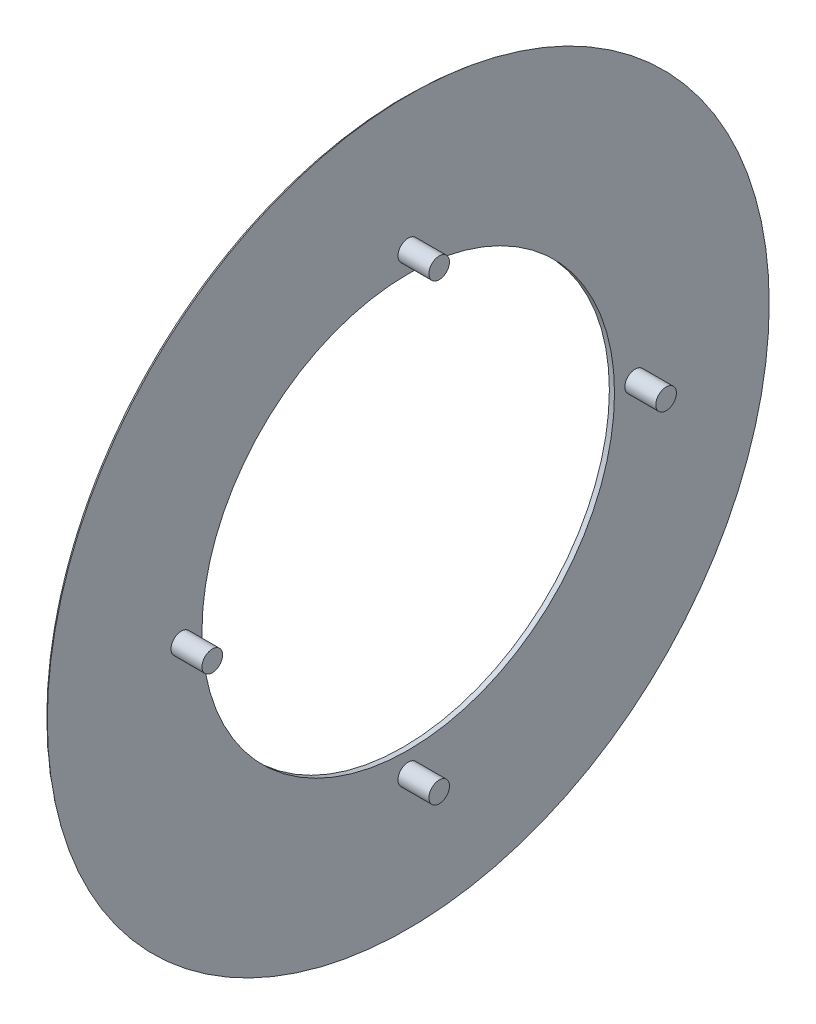
ISO-10303-21;
HEADER;
FILE_DESCRIPTION(('STEP AP214'),'2;1');
FILE_NAME('part.step','',(''),(''),'','','');
FILE_SCHEMA(('AUTOMOTIVE_DESIGN { 1 0 10303 214 1 1 1 1 }'));
ENDSEC;
DATA;
#1=APPLICATION_CONTEXT('core data for automotive mechanical design processes');
#2=APPLICATION_PROTOCOL_DEFINITION('international standard','automotive_design',2000,#1);
#3=PRODUCT_CONTEXT('',#1,'mechanical');
#4=PRODUCT('Part','Part','',(#3));
#5=PRODUCT_RELATED_PRODUCT_CATEGORY('part','',(#4));
#6=PRODUCT_DEFINITION_FORMATION('','',#4);
#7=PRODUCT_DEFINITION_CONTEXT('part definition',#1,'design');
#8=PRODUCT_DEFINITION('design','',#6,#7);
#9=PRODUCT_DEFINITION_SHAPE('','',#8);
#10=(LENGTH_UNIT() NAMED_UNIT(*) SI_UNIT(.MILLI.,.METRE.));
#11=(NAMED_UNIT(*) PLANE_ANGLE_UNIT() SI_UNIT($,.RADIAN.));
#12=(NAMED_UNIT(*) SI_UNIT($,.STERADIAN.) SOLID_ANGLE_UNIT());
#13=UNCERTAINTY_MEASURE_WITH_UNIT(LENGTH_MEASURE(1.E-05),#10,'distance_accuracy_value','');
#14=(GEOMETRIC_REPRESENTATION_CONTEXT(3) GLOBAL_UNCERTAINTY_ASSIGNED_CONTEXT((#13)) GLOBAL_UNIT_ASSIGNED_CONTEXT((#10,
#11,#12)) REPRESENTATION_CONTEXT('',''));
#15=CARTESIAN_POINT('',(0.,0.,0.));
#16=DIRECTION('',(0.,0.,1.));
#17=DIRECTION('',(1.,0.,0.));
#18=AXIS2_PLACEMENT_3D('',#15,#16,#17);
#19=CARTESIAN_POINT('',(0.635,0.,0.));
#20=DIRECTION('',(1.,0.,0.));
#21=DIRECTION('',(0.,0.,-1.));
#22=AXIS2_PLACEMENT_3D('',#19,#20,#21);
#23=PLANE('',#22);
#24=CARTESIAN_POINT('',(0.635,0.,0.));
#25=DIRECTION('',(1.,0.,0.));
#26=DIRECTION('',(0.,0.,-1.));
#27=AXIS2_PLACEMENT_3D('',#24,#25,#26);
#28=CIRCLE('',#27,25.4);
#29=CARTESIAN_POINT('',(0.635,0.,-25.4));
#30=VERTEX_POINT('',#29);
#31=EDGE_CURVE('E73',#30,#30,#28,.T.);
#32=ORIENTED_EDGE('',*,*,#31,.F.);
#33=EDGE_LOOP('',(#32));
#34=FACE_BOUND('',#33,.T.);
#35=CARTESIAN_POINT('',(0.635,-27.94,0.));
#36=DIRECTION('',(1.,0.,0.));
#37=DIRECTION('',(0.,0.,-1.));
#38=AXIS2_PLACEMENT_3D('',#35,#36,#37);
#39=CIRCLE('',#38,1.27);
#40=CARTESIAN_POINT('',(0.635,-27.94,1.26999999999999));
#41=VERTEX_POINT('',#40);
#42=EDGE_CURVE('E59',#41,#41,#39,.T.);
#43=ORIENTED_EDGE('',*,*,#42,.F.);
#44=EDGE_LOOP('',(#43));
#45=FACE_BOUND('',#44,.T.);
#46=CARTESIAN_POINT('',(0.635,27.94,0.));
#47=DIRECTION('',(1.,0.,0.));
#48=DIRECTION('',(0.,0.,-1.));
#49=AXIS2_PLACEMENT_3D('',#46,#47,#48);
#50=CIRCLE('',#49,1.27);
#51=CARTESIAN_POINT('',(0.635,27.94,1.27));
#52=VERTEX_POINT('',#51);
#53=EDGE_CURVE('E47',#52,#52,#50,.T.);
#54=ORIENTED_EDGE('',*,*,#53,.F.);
#55=EDGE_LOOP('',(#54));
#56=FACE_BOUND('',#55,.T.);
#57=CARTESIAN_POINT('',(0.635,0.,0.));
#58=DIRECTION('',(1.,0.,0.));
#59=DIRECTION('',(0.,0.,-1.));
#60=AXIS2_PLACEMENT_3D('',#57,#58,#59);
#61=CIRCLE('',#60,44.45);
#62=CARTESIAN_POINT('',(0.635,0.,-44.45));
#63=VERTEX_POINT('',#62);
#64=EDGE_CURVE('E39',#63,#63,#61,.T.);
#65=ORIENTED_EDGE('',*,*,#64,.T.);
#66=EDGE_LOOP('',(#65));
#67=FACE_BOUND('',#66,.T.);
#68=CARTESIAN_POINT('',(0.635,0.,-27.94));
#69=DIRECTION('',(1.,0.,0.));
#70=DIRECTION('',(0.,0.,-1.));
#71=AXIS2_PLACEMENT_3D('',#68,#69,#70);
#72=CIRCLE('',#71,1.27);
#73=CARTESIAN_POINT('',(0.635,0.,-26.67));
#74=VERTEX_POINT('',#73);
#75=EDGE_CURVE('E53',#74,#74,#72,.T.);
#76=ORIENTED_EDGE('',*,*,#75,.F.);
#77=EDGE_LOOP('',(#76));
#78=FACE_BOUND('',#77,.T.);
#79=CARTESIAN_POINT('',(0.635,0.,27.94));
#80=DIRECTION('',(1.,0.,0.));
#81=DIRECTION('',(0.,0.,-1.));
#82=AXIS2_PLACEMENT_3D('',#79,#80,#81);
#83=CIRCLE('',#82,1.27);
#84=CARTESIAN_POINT('',(0.635,0.,29.21));
#85=VERTEX_POINT('',#84);
#86=EDGE_CURVE('E65',#85,#85,#83,.T.);
#87=ORIENTED_EDGE('',*,*,#86,.F.);
#88=EDGE_LOOP('',(#87));
#89=FACE_BOUND('',#88,.T.);
#90=ADVANCED_FACE('F32',(#34,#45,#56,#67,#78,#89),#23,.T.);
#91=CARTESIAN_POINT('',(0.,0.,0.));
#92=DIRECTION('',(1.,0.,0.));
#93=DIRECTION('',(0.,0.,-1.));
#94=AXIS2_PLACEMENT_3D('',#91,#92,#93);
#95=PLANE('',#94);
#96=CARTESIAN_POINT('',(0.,0.,0.));
#97=DIRECTION('',(1.,0.,0.));
#98=DIRECTION('',(0.,0.,-1.));
#99=AXIS2_PLACEMENT_3D('',#96,#97,#98);
#100=CIRCLE('',#99,43.3501477371938);
#101=CARTESIAN_POINT('',(0.,0.,-43.3501477371938));
#102=VERTEX_POINT('',#101);
#103=EDGE_CURVE('E10',#102,#102,#100,.F.);
#104=ORIENTED_EDGE('',*,*,#103,.T.);
#105=EDGE_LOOP('',(#104));
#106=FACE_BOUND('',#105,.T.);
#107=CARTESIAN_POINT('',(0.,0.,0.));
#108=DIRECTION('',(1.,0.,0.));
#109=DIRECTION('',(0.,0.,-1.));
#110=AXIS2_PLACEMENT_3D('',#107,#108,#109);
#111=CIRCLE('',#110,25.4);
#112=CARTESIAN_POINT('',(0.,0.,-25.4));
#113=VERTEX_POINT('',#112);
#114=EDGE_CURVE('E68',#113,#113,#111,.F.);
#115=ORIENTED_EDGE('',*,*,#114,.F.);
#116=EDGE_LOOP('',(#115));
#117=FACE_BOUND('',#116,.T.);
#118=ADVANCED_FACE('F82',(#106,#117),#95,.F.);
#119=CARTESIAN_POINT('',(4.445,27.94,0.));
#120=DIRECTION('',(-1.,0.,0.));
#121=DIRECTION('',(0.,0.,1.));
#122=AXIS2_PLACEMENT_3D('',#119,#120,#121);
#123=CYLINDRICAL_SURFACE('',#122,1.27);
#124=CARTESIAN_POINT('',(4.445,27.94,0.));
#125=DIRECTION('',(1.,0.,0.));
#126=DIRECTION('',(0.,0.,-1.));
#127=AXIS2_PLACEMENT_3D('',#124,#125,#126);
#128=CIRCLE('',#127,1.27);
#129=CARTESIAN_POINT('',(4.445,27.94,1.27));
#130=VERTEX_POINT('',#129);
#131=EDGE_CURVE('E43',#130,#130,#128,.T.);
#132=CARTESIAN_POINT('',(4.445,27.94,1.27));
#133=CARTESIAN_POINT('',(4.4053125,27.94,1.27));
#134=CARTESIAN_POINT('',(4.365625,27.94,1.27));
#135=CARTESIAN_POINT('',(4.28625,27.94,1.27));
#136=CARTESIAN_POINT('',(4.2465625,27.94,1.27));
#137=CARTESIAN_POINT('',(4.1671875,27.94,1.27));
#138=CARTESIAN_POINT('',(4.1275,27.94,1.27));
#139=CARTESIAN_POINT('',(4.048125,27.94,1.27));
#140=CARTESIAN_POINT('',(4.0084375,27.94,1.27));
#141=CARTESIAN_POINT('',(3.9290625,27.94,1.27));
#142=CARTESIAN_POINT('',(3.889375,27.94,1.27));
#143=CARTESIAN_POINT('',(3.81,27.94,1.27));
#144=CARTESIAN_POINT('',(3.7703125,27.94,1.27));
#145=CARTESIAN_POINT('',(3.6909375,27.94,1.27));
#146=CARTESIAN_POINT('',(3.65125,27.94,1.27));
#147=CARTESIAN_POINT('',(3.571875,27.94,1.27));
#148=CARTESIAN_POINT('',(3.5321875,27.94,1.27));
#149=CARTESIAN_POINT('',(3.4528125,27.94,1.27));
#150=CARTESIAN_POINT('',(3.413125,27.94,1.27));
#151=CARTESIAN_POINT('',(3.33375,27.94,1.27));
#152=CARTESIAN_POINT('',(3.2940625,27.94,1.27));
#153=CARTESIAN_POINT('',(3.2146875,27.94,1.27));
#154=CARTESIAN_POINT('',(3.175,27.94,1.27));
#155=CARTESIAN_POINT('',(3.095625,27.94,1.27));
#156=CARTESIAN_POINT('',(3.0559375,27.94,1.27));
#157=CARTESIAN_POINT('',(2.9765625,27.94,1.27));
#158=CARTESIAN_POINT('',(2.936875,27.94,1.27));
#159=CARTESIAN_POINT('',(2.8575,27.94,1.27));
#160=CARTESIAN_POINT('',(2.8178125,27.94,1.27));
#161=CARTESIAN_POINT('',(2.7384375,27.94,1.27));
#162=CARTESIAN_POINT('',(2.69875,27.94,1.27));
#163=CARTESIAN_POINT('',(2.619375,27.94,1.27));
#164=CARTESIAN_POINT('',(2.5796875,27.94,1.27));
#165=CARTESIAN_POINT('',(2.5003125,27.94,1.27));
#166=CARTESIAN_POINT('',(2.460625,27.94,1.27));
#167=CARTESIAN_POINT('',(2.38125,27.94,1.27));
#168=CARTESIAN_POINT('',(2.3415625,27.94,1.27));
#169=CARTESIAN_POINT('',(2.2621875,27.94,1.27));
#170=CARTESIAN_POINT('',(2.2225,27.94,1.27));
#171=CARTESIAN_POINT('',(2.143125,27.94,1.27));
#172=CARTESIAN_POINT('',(2.1034375,27.94,1.27));
#173=CARTESIAN_POINT('',(2.0240625,27.94,1.27));
#174=CARTESIAN_POINT('',(1.984375,27.94,1.27));
#175=CARTESIAN_POINT('',(1.905,27.94,1.27));
#176=CARTESIAN_POINT('',(1.8653125,27.94,1.27));
#177=CARTESIAN_POINT('',(1.7859375,27.94,1.27));
#178=CARTESIAN_POINT('',(1.74625,27.94,1.27));
#179=CARTESIAN_POINT('',(1.666875,27.94,1.27));
#180=CARTESIAN_POINT('',(1.6271875,27.94,1.27));
#181=CARTESIAN_POINT('',(1.5478125,27.94,1.27));
#182=CARTESIAN_POINT('',(1.508125,27.94,1.27));
#183=CARTESIAN_POINT('',(1.42875,27.94,1.27));
#184=CARTESIAN_POINT('',(1.3890625,27.94,1.27));
#185=CARTESIAN_POINT('',(1.3096875,27.94,1.27));
#186=CARTESIAN_POINT('',(1.27,27.94,1.27));
#187=CARTESIAN_POINT('',(1.190625,27.94,1.27));
#188=CARTESIAN_POINT('',(1.1509375,27.94,1.27));
#189=CARTESIAN_POINT('',(1.0715625,27.94,1.27));
#190=CARTESIAN_POINT('',(1.031875,27.94,1.27));
#191=CARTESIAN_POINT('',(0.9525,27.94,1.27));
#192=CARTESIAN_POINT('',(0.9128125,27.94,1.27));
#193=CARTESIAN_POINT('',(0.8334375,27.94,1.27));
#194=CARTESIAN_POINT('',(0.79375,27.94,1.27));
#195=CARTESIAN_POINT('',(0.714375,27.94,1.27));
#196=CARTESIAN_POINT('',(0.6746875,27.94,1.27));
#197=CARTESIAN_POINT('',(0.635,27.94,1.27));
#198=B_SPLINE_CURVE_WITH_KNOTS('',3,(#132,#133,#134,#135,#136,#137,#138,#139,#140,#141,#142,
#143,#144,#145,#146,#147,#148,#149,#150,#151,#152,#153,#154,#155,#156,#157,#158,#159,#160,#161,
#162,#163,#164,#165,#166,#167,#168,#169,#170,#171,#172,#173,#174,#175,#176,#177,#178,#179,#180,
#181,#182,#183,#184,#185,#186,#187,#188,#189,#190,#191,#192,#193,#194,#195,#196,#197),
.UNSPECIFIED.,.F.,.F.,(4,2,2,2,2,2,2,2,2,2,2,2,2,2,2,2,2,2,2,2,2,2,2,2,2,2,2,2,2,2,2,2,4),(0.,
0.119062499999999,0.238125,0.3571875,0.476249999999999,0.595312499999999,0.714374999999999,
0.833437499999999,0.952499999999999,1.0715625,1.190625,1.3096875,1.42875,1.5478125,1.666875,
1.7859375,1.905,2.0240625,2.143125,2.2621875,2.38125,2.5003125,2.619375,2.7384375,2.8575,
2.9765625,3.095625,3.2146875,3.33375,3.4528125,3.571875,3.6909375,3.81),.UNSPECIFIED.);
#199=EDGE_CURVE('BSEAM124',#130,#52,#198,.T.);
#200=ORIENTED_EDGE('',*,*,#131,.F.);
#201=ORIENTED_EDGE('',*,*,#53,.T.);
#202=ORIENTED_EDGE('',*,*,#199,.T.);
#203=ORIENTED_EDGE('',*,*,#199,.F.);
#204=EDGE_LOOP('',(#200,#202,#201,#203));
#205=FACE_BOUND('',#204,.T.);
#206=ADVANCED_FACE('F124',(#205),#123,.T.);
#207=CARTESIAN_POINT('',(4.445,27.94,0.));
#208=DIRECTION('',(1.,0.,0.));
#209=DIRECTION('',(0.,0.,-1.));
#210=AXIS2_PLACEMENT_3D('',#207,#208,#209);
#211=PLANE('',#210);
#212=ORIENTED_EDGE('',*,*,#131,.T.);
#213=EDGE_LOOP('',(#212));
#214=FACE_BOUND('',#213,.T.);
#215=ADVANCED_FACE('F120',(#214),#211,.T.);
#216=CARTESIAN_POINT('',(4.445,0.,-27.94));
#217=DIRECTION('',(-1.,0.,0.));
#218=DIRECTION('',(0.,0.,1.));
#219=AXIS2_PLACEMENT_3D('',#216,#217,#218);
#220=CYLINDRICAL_SURFACE('',#219,1.27);
#221=CARTESIAN_POINT('',(4.445,0.,-27.94));
#222=DIRECTION('',(1.,0.,0.));
#223=DIRECTION('',(0.,0.,-1.));
#224=AXIS2_PLACEMENT_3D('',#221,#222,#223);
#225=CIRCLE('',#224,1.27);
#226=CARTESIAN_POINT('',(4.445,0.,-26.67));
#227=VERTEX_POINT('',#226);
#228=EDGE_CURVE('E51',#227,#227,#225,.T.);
#229=CARTESIAN_POINT('',(4.445,0.,-26.67));
#230=CARTESIAN_POINT('',(4.4053125,0.,-26.67));
#231=CARTESIAN_POINT('',(4.365625,0.,-26.67));
#232=CARTESIAN_POINT('',(4.28625,0.,-26.67));
#233=CARTESIAN_POINT('',(4.2465625,0.,-26.67));
#234=CARTESIAN_POINT('',(4.1671875,0.,-26.67));
#235=CARTESIAN_POINT('',(4.1275,0.,-26.67));
#236=CARTESIAN_POINT('',(4.048125,0.,-26.67));
#237=CARTESIAN_POINT('',(4.0084375,0.,-26.67));
#238=CARTESIAN_POINT('',(3.9290625,0.,-26.67));
#239=CARTESIAN_POINT('',(3.889375,0.,-26.67));
#240=CARTESIAN_POINT('',(3.81,0.,-26.67));
#241=CARTESIAN_POINT('',(3.7703125,0.,-26.67));
#242=CARTESIAN_POINT('',(3.6909375,0.,-26.67));
#243=CARTESIAN_POINT('',(3.65125,0.,-26.67));
#244=CARTESIAN_POINT('',(3.571875,0.,-26.67));
#245=CARTESIAN_POINT('',(3.5321875,0.,-26.67));
#246=CARTESIAN_POINT('',(3.4528125,0.,-26.67));
#247=CARTESIAN_POINT('',(3.413125,0.,-26.67));
#248=CARTESIAN_POINT('',(3.33375,0.,-26.67));
#249=CARTESIAN_POINT('',(3.2940625,0.,-26.67));
#250=CARTESIAN_POINT('',(3.2146875,0.,-26.67));
#251=CARTESIAN_POINT('',(3.175,0.,-26.67));
#252=CARTESIAN_POINT('',(3.095625,0.,-26.67));
#253=CARTESIAN_POINT('',(3.0559375,0.,-26.67));
#254=CARTESIAN_POINT('',(2.9765625,0.,-26.67));
#255=CARTESIAN_POINT('',(2.936875,0.,-26.67));
#256=CARTESIAN_POINT('',(2.8575,0.,-26.67));
#257=CARTESIAN_POINT('',(2.8178125,0.,-26.67));
#258=CARTESIAN_POINT('',(2.7384375,0.,-26.67));
#259=CARTESIAN_POINT('',(2.69875,0.,-26.67));
#260=CARTESIAN_POINT('',(2.619375,0.,-26.67));
#261=CARTESIAN_POINT('',(2.5796875,0.,-26.67));
#262=CARTESIAN_POINT('',(2.5003125,0.,-26.67));
#263=CARTESIAN_POINT('',(2.460625,0.,-26.67));
#264=CARTESIAN_POINT('',(2.38125,0.,-26.67));
#265=CARTESIAN_POINT('',(2.3415625,0.,-26.67));
#266=CARTESIAN_POINT('',(2.2621875,0.,-26.67));
#267=CARTESIAN_POINT('',(2.2225,0.,-26.67));
#268=CARTESIAN_POINT('',(2.143125,0.,-26.67));
#269=CARTESIAN_POINT('',(2.1034375,0.,-26.67));
#270=CARTESIAN_POINT('',(2.0240625,0.,-26.67));
#271=CARTESIAN_POINT('',(1.984375,0.,-26.67));
#272=CARTESIAN_POINT('',(1.905,0.,-26.67));
#273=CARTESIAN_POINT('',(1.8653125,0.,-26.67));
#274=CARTESIAN_POINT('',(1.7859375,0.,-26.67));
#275=CARTESIAN_POINT('',(1.74625,0.,-26.67));
#276=CARTESIAN_POINT('',(1.666875,0.,-26.67));
#277=CARTESIAN_POINT('',(1.6271875,0.,-26.67));
#278=CARTESIAN_POINT('',(1.5478125,0.,-26.67));
#279=CARTESIAN_POINT('',(1.508125,0.,-26.67));
#280=CARTESIAN_POINT('',(1.42875,0.,-26.67));
#281=CARTESIAN_POINT('',(1.3890625,0.,-26.67));
#282=CARTESIAN_POINT('',(1.3096875,0.,-26.67));
#283=CARTESIAN_POINT('',(1.27,0.,-26.67));
#284=CARTESIAN_POINT('',(1.190625,0.,-26.67));
#285=CARTESIAN_POINT('',(1.1509375,0.,-26.67));
#286=CARTESIAN_POINT('',(1.0715625,0.,-26.67));
#287=CARTESIAN_POINT('',(1.031875,0.,-26.67));
#288=CARTESIAN_POINT('',(0.9525,0.,-26.67));
#289=CARTESIAN_POINT('',(0.9128125,0.,-26.67));
#290=CARTESIAN_POINT('',(0.8334375,0.,-26.67));
#291=CARTESIAN_POINT('',(0.79375,0.,-26.67));
#292=CARTESIAN_POINT('',(0.714375,0.,-26.67));
#293=CARTESIAN_POINT('',(0.6746875,0.,-26.67));
#294=CARTESIAN_POINT('',(0.635,0.,-26.67));
#295=B_SPLINE_CURVE_WITH_KNOTS('',3,(#229,#230,#231,#232,#233,#234,#235,#236,#237,#238,#239,
#240,#241,#242,#243,#244,#245,#246,#247,#248,#249,#250,#251,#252,#253,#254,#255,#256,#257,#258,
#259,#260,#261,#262,#263,#264,#265,#266,#267,#268,#269,#270,#271,#272,#273,#274,#275,#276,#277,
#278,#279,#280,#281,#282,#283,#284,#285,#286,#287,#288,#289,#290,#291,#292,#293,#294),
.UNSPECIFIED.,.F.,.F.,(4,2,2,2,2,2,2,2,2,2,2,2,2,2,2,2,2,2,2,2,2,2,2,2,2,2,2,2,2,2,2,2,4),(0.,
0.119062499999999,0.238125,0.3571875,0.476249999999999,0.595312499999999,0.714374999999999,
0.833437499999999,0.952499999999999,1.0715625,1.190625,1.3096875,1.42875,1.5478125,1.666875,
1.7859375,1.905,2.0240625,2.143125,2.2621875,2.38125,2.5003125,2.619375,2.7384375,2.8575,
2.9765625,3.095625,3.2146875,3.33375,3.4528125,3.571875,3.6909375,3.81),.UNSPECIFIED.);
#296=EDGE_CURVE('BSEAM116',#227,#74,#295,.T.);
#297=ORIENTED_EDGE('',*,*,#228,.F.);
#298=ORIENTED_EDGE('',*,*,#75,.T.);
#299=ORIENTED_EDGE('',*,*,#296,.T.);
#300=ORIENTED_EDGE('',*,*,#296,.F.);
#301=EDGE_LOOP('',(#297,#299,#298,#300));
#302=FACE_BOUND('',#301,.T.);
#303=ADVANCED_FACE('F116',(#302),#220,.T.);
#304=CARTESIAN_POINT('',(4.445,0.,-27.94));
#305=DIRECTION('',(1.,0.,0.));
#306=DIRECTION('',(0.,0.,-1.));
#307=AXIS2_PLACEMENT_3D('',#304,#305,#306);
#308=PLANE('',#307);
#309=ORIENTED_EDGE('',*,*,#228,.T.);
#310=EDGE_LOOP('',(#309));
#311=FACE_BOUND('',#310,.T.);
#312=ADVANCED_FACE('F112',(#311),#308,.T.);
#313=CARTESIAN_POINT('',(4.445,-27.94,0.));
#314=DIRECTION('',(-1.,0.,0.));
#315=DIRECTION('',(0.,0.,1.));
#316=AXIS2_PLACEMENT_3D('',#313,#314,#315);
#317=CYLINDRICAL_SURFACE('',#316,1.27);
#318=CARTESIAN_POINT('',(4.445,-27.94,0.));
#319=DIRECTION('',(1.,0.,0.));
#320=DIRECTION('',(0.,0.,-1.));
#321=AXIS2_PLACEMENT_3D('',#318,#319,#320);
#322=CIRCLE('',#321,1.27);
#323=CARTESIAN_POINT('',(4.445,-27.94,1.26999999999999));
#324=VERTEX_POINT('',#323);
#325=EDGE_CURVE('E56',#324,#324,#322,.T.);
#326=CARTESIAN_POINT('',(4.445,-27.94,1.26999999999999));
#327=CARTESIAN_POINT('',(4.4053125,-27.94,1.26999999999999));
#328=CARTESIAN_POINT('',(4.365625,-27.94,1.26999999999999));
#329=CARTESIAN_POINT('',(4.28625,-27.94,1.26999999999999));
#330=CARTESIAN_POINT('',(4.2465625,-27.94,1.26999999999999));
#331=CARTESIAN_POINT('',(4.1671875,-27.94,1.26999999999999));
#332=CARTESIAN_POINT('',(4.1275,-27.94,1.26999999999999));
#333=CARTESIAN_POINT('',(4.048125,-27.94,1.26999999999999));
#334=CARTESIAN_POINT('',(4.0084375,-27.94,1.26999999999999));
#335=CARTESIAN_POINT('',(3.9290625,-27.94,1.26999999999999));
#336=CARTESIAN_POINT('',(3.889375,-27.94,1.26999999999999));
#337=CARTESIAN_POINT('',(3.81,-27.94,1.26999999999999));
#338=CARTESIAN_POINT('',(3.7703125,-27.94,1.26999999999999));
#339=CARTESIAN_POINT('',(3.6909375,-27.94,1.26999999999999));
#340=CARTESIAN_POINT('',(3.65125,-27.94,1.26999999999999));
#341=CARTESIAN_POINT('',(3.571875,-27.94,1.26999999999999));
#342=CARTESIAN_POINT('',(3.5321875,-27.94,1.26999999999999));
#343=CARTESIAN_POINT('',(3.4528125,-27.94,1.26999999999999));
#344=CARTESIAN_POINT('',(3.413125,-27.94,1.26999999999999));
#345=CARTESIAN_POINT('',(3.33375,-27.94,1.26999999999999));
#346=CARTESIAN_POINT('',(3.2940625,-27.94,1.26999999999999));
#347=CARTESIAN_POINT('',(3.2146875,-27.94,1.26999999999999));
#348=CARTESIAN_POINT('',(3.175,-27.94,1.26999999999999));
#349=CARTESIAN_POINT('',(3.095625,-27.94,1.26999999999999));
#350=CARTESIAN_POINT('',(3.0559375,-27.94,1.26999999999999));
#351=CARTESIAN_POINT('',(2.9765625,-27.94,1.26999999999999));
#352=CARTESIAN_POINT('',(2.936875,-27.94,1.26999999999999));
#353=CARTESIAN_POINT('',(2.8575,-27.94,1.26999999999999));
#354=CARTESIAN_POINT('',(2.8178125,-27.94,1.26999999999999));
#355=CARTESIAN_POINT('',(2.7384375,-27.94,1.26999999999999));
#356=CARTESIAN_POINT('',(2.69875,-27.94,1.26999999999999));
#357=CARTESIAN_POINT('',(2.619375,-27.94,1.26999999999999));
#358=CARTESIAN_POINT('',(2.5796875,-27.94,1.26999999999999));
#359=CARTESIAN_POINT('',(2.5003125,-27.94,1.26999999999999));
#360=CARTESIAN_POINT('',(2.460625,-27.94,1.26999999999999));
#361=CARTESIAN_POINT('',(2.38125,-27.94,1.26999999999999));
#362=CARTESIAN_POINT('',(2.3415625,-27.94,1.26999999999999));
#363=CARTESIAN_POINT('',(2.2621875,-27.94,1.26999999999999));
#364=CARTESIAN_POINT('',(2.2225,-27.94,1.26999999999999));
#365=CARTESIAN_POINT('',(2.143125,-27.94,1.26999999999999));
#366=CARTESIAN_POINT('',(2.1034375,-27.94,1.26999999999999));
#367=CARTESIAN_POINT('',(2.0240625,-27.94,1.26999999999999));
#368=CARTESIAN_POINT('',(1.984375,-27.94,1.26999999999999));
#369=CARTESIAN_POINT('',(1.905,-27.94,1.26999999999999));
#370=CARTESIAN_POINT('',(1.8653125,-27.94,1.26999999999999));
#371=CARTESIAN_POINT('',(1.7859375,-27.94,1.26999999999999));
#372=CARTESIAN_POINT('',(1.74625,-27.94,1.26999999999999));
#373=CARTESIAN_POINT('',(1.666875,-27.94,1.26999999999999));
#374=CARTESIAN_POINT('',(1.6271875,-27.94,1.26999999999999));
#375=CARTESIAN_POINT('',(1.5478125,-27.94,1.26999999999999));
#376=CARTESIAN_POINT('',(1.508125,-27.94,1.26999999999999));
#377=CARTESIAN_POINT('',(1.42875,-27.94,1.26999999999999));
#378=CARTESIAN_POINT('',(1.3890625,-27.94,1.26999999999999));
#379=CARTESIAN_POINT('',(1.3096875,-27.94,1.26999999999999));
#380=CARTESIAN_POINT('',(1.27,-27.94,1.26999999999999));
#381=CARTESIAN_POINT('',(1.190625,-27.94,1.26999999999999));
#382=CARTESIAN_POINT('',(1.1509375,-27.94,1.26999999999999));
#383=CARTESIAN_POINT('',(1.0715625,-27.94,1.26999999999999));
#384=CARTESIAN_POINT('',(1.031875,-27.94,1.26999999999999));
#385=CARTESIAN_POINT('',(0.9525,-27.94,1.26999999999999));
#386=CARTESIAN_POINT('',(0.9128125,-27.94,1.26999999999999));
#387=CARTESIAN_POINT('',(0.8334375,-27.94,1.26999999999999));
#388=CARTESIAN_POINT('',(0.79375,-27.94,1.26999999999999));
#389=CARTESIAN_POINT('',(0.714375,-27.94,1.26999999999999));
#390=CARTESIAN_POINT('',(0.6746875,-27.94,1.26999999999999));
#391=CARTESIAN_POINT('',(0.635,-27.94,1.26999999999999));
#392=B_SPLINE_CURVE_WITH_KNOTS('',3,(#326,#327,#328,#329,#330,#331,#332,#333,#334,#335,#336,
#337,#338,#339,#340,#341,#342,#343,#344,#345,#346,#347,#348,#349,#350,#351,#352,#353,#354,#355,
#356,#357,#358,#359,#360,#361,#362,#363,#364,#365,#366,#367,#368,#369,#370,#371,#372,#373,#374,
#375,#376,#377,#378,#379,#380,#381,#382,#383,#384,#385,#386,#387,#388,#389,#390,#391),
.UNSPECIFIED.,.F.,.F.,(4,2,2,2,2,2,2,2,2,2,2,2,2,2,2,2,2,2,2,2,2,2,2,2,2,2,2,2,2,2,2,2,4),(0.,
0.119062499999999,0.238125,0.3571875,0.476249999999999,0.595312499999999,0.714374999999999,
0.833437499999999,0.952499999999999,1.0715625,1.190625,1.3096875,1.42875,1.5478125,1.666875,
1.7859375,1.905,2.0240625,2.143125,2.2621875,2.38125,2.5003125,2.619375,2.7384375,2.8575,
2.9765625,3.095625,3.2146875,3.33375,3.4528125,3.571875,3.6909375,3.81),.UNSPECIFIED.);
#393=EDGE_CURVE('BSEAM104',#324,#41,#392,.T.);
#394=ORIENTED_EDGE('',*,*,#325,.F.);
#395=ORIENTED_EDGE('',*,*,#42,.T.);
#396=ORIENTED_EDGE('',*,*,#393,.T.);
#397=ORIENTED_EDGE('',*,*,#393,.F.);
#398=EDGE_LOOP('',(#394,#396,#395,#397));
#399=FACE_BOUND('',#398,.T.);
#400=ADVANCED_FACE('F104',(#399),#317,.T.);
#401=CARTESIAN_POINT('',(4.445,-27.94,0.));
#402=DIRECTION('',(1.,0.,0.));
#403=DIRECTION('',(0.,0.,-1.));
#404=AXIS2_PLACEMENT_3D('',#401,#402,#403);
#405=PLANE('',#404);
#406=ORIENTED_EDGE('',*,*,#325,.T.);
#407=EDGE_LOOP('',(#406));
#408=FACE_BOUND('',#407,.T.);
#409=ADVANCED_FACE('F95',(#408),#405,.T.);
#410=CARTESIAN_POINT('',(4.445,0.,27.94));
#411=DIRECTION('',(-1.,0.,0.));
#412=DIRECTION('',(0.,0.,1.));
#413=AXIS2_PLACEMENT_3D('',#410,#411,#412);
#414=CYLINDRICAL_SURFACE('',#413,1.27);
#415=CARTESIAN_POINT('',(4.445,0.,27.94));
#416=DIRECTION('',(1.,0.,0.));
#417=DIRECTION('',(0.,0.,-1.));
#418=AXIS2_PLACEMENT_3D('',#415,#416,#417);
#419=CIRCLE('',#418,1.27);
#420=CARTESIAN_POINT('',(4.445,0.,29.21));
#421=VERTEX_POINT('',#420);
#422=EDGE_CURVE('E62',#421,#421,#419,.T.);
#423=CARTESIAN_POINT('',(4.445,0.,29.21));
#424=CARTESIAN_POINT('',(4.4053125,0.,29.21));
#425=CARTESIAN_POINT('',(4.365625,0.,29.21));
#426=CARTESIAN_POINT('',(4.28625,0.,29.21));
#427=CARTESIAN_POINT('',(4.2465625,0.,29.21));
#428=CARTESIAN_POINT('',(4.1671875,0.,29.21));
#429=CARTESIAN_POINT('',(4.1275,0.,29.21));
#430=CARTESIAN_POINT('',(4.048125,0.,29.21));
#431=CARTESIAN_POINT('',(4.0084375,0.,29.21));
#432=CARTESIAN_POINT('',(3.9290625,0.,29.21));
#433=CARTESIAN_POINT('',(3.889375,0.,29.21));
#434=CARTESIAN_POINT('',(3.81,0.,29.21));
#435=CARTESIAN_POINT('',(3.7703125,0.,29.21));
#436=CARTESIAN_POINT('',(3.6909375,0.,29.21));
#437=CARTESIAN_POINT('',(3.65125,0.,29.21));
#438=CARTESIAN_POINT('',(3.571875,0.,29.21));
#439=CARTESIAN_POINT('',(3.5321875,0.,29.21));
#440=CARTESIAN_POINT('',(3.4528125,0.,29.21));
#441=CARTESIAN_POINT('',(3.413125,0.,29.21));
#442=CARTESIAN_POINT('',(3.33375,0.,29.21));
#443=CARTESIAN_POINT('',(3.2940625,0.,29.21));
#444=CARTESIAN_POINT('',(3.2146875,0.,29.21));
#445=CARTESIAN_POINT('',(3.175,0.,29.21));
#446=CARTESIAN_POINT('',(3.095625,0.,29.21));
#447=CARTESIAN_POINT('',(3.0559375,0.,29.21));
#448=CARTESIAN_POINT('',(2.9765625,0.,29.21));
#449=CARTESIAN_POINT('',(2.936875,0.,29.21));
#450=CARTESIAN_POINT('',(2.8575,0.,29.21));
#451=CARTESIAN_POINT('',(2.8178125,0.,29.21));
#452=CARTESIAN_POINT('',(2.7384375,0.,29.21));
#453=CARTESIAN_POINT('',(2.69875,0.,29.21));
#454=CARTESIAN_POINT('',(2.619375,0.,29.21));
#455=CARTESIAN_POINT('',(2.5796875,0.,29.21));
#456=CARTESIAN_POINT('',(2.5003125,0.,29.21));
#457=CARTESIAN_POINT('',(2.460625,0.,29.21));
#458=CARTESIAN_POINT('',(2.38125,0.,29.21));
#459=CARTESIAN_POINT('',(2.3415625,0.,29.21));
#460=CARTESIAN_POINT('',(2.2621875,0.,29.21));
#461=CARTESIAN_POINT('',(2.2225,0.,29.21));
#462=CARTESIAN_POINT('',(2.143125,0.,29.21));
#463=CARTESIAN_POINT('',(2.1034375,0.,29.21));
#464=CARTESIAN_POINT('',(2.0240625,0.,29.21));
#465=CARTESIAN_POINT('',(1.984375,0.,29.21));
#466=CARTESIAN_POINT('',(1.905,0.,29.21));
#467=CARTESIAN_POINT('',(1.8653125,0.,29.21));
#468=CARTESIAN_POINT('',(1.7859375,0.,29.21));
#469=CARTESIAN_POINT('',(1.74625,0.,29.21));
#470=CARTESIAN_POINT('',(1.666875,0.,29.21));
#471=CARTESIAN_POINT('',(1.6271875,0.,29.21));
#472=CARTESIAN_POINT('',(1.5478125,0.,29.21));
#473=CARTESIAN_POINT('',(1.508125,0.,29.21));
#474=CARTESIAN_POINT('',(1.42875,0.,29.21));
#475=CARTESIAN_POINT('',(1.3890625,0.,29.21));
#476=CARTESIAN_POINT('',(1.3096875,0.,29.21));
#477=CARTESIAN_POINT('',(1.27,0.,29.21));
#478=CARTESIAN_POINT('',(1.190625,0.,29.21));
#479=CARTESIAN_POINT('',(1.1509375,0.,29.21));
#480=CARTESIAN_POINT('',(1.0715625,0.,29.21));
#481=CARTESIAN_POINT('',(1.031875,0.,29.21));
#482=CARTESIAN_POINT('',(0.9525,0.,29.21));
#483=CARTESIAN_POINT('',(0.9128125,0.,29.21));
#484=CARTESIAN_POINT('',(0.8334375,0.,29.21));
#485=CARTESIAN_POINT('',(0.79375,0.,29.21));
#486=CARTESIAN_POINT('',(0.714375,0.,29.21));
#487=CARTESIAN_POINT('',(0.6746875,0.,29.21));
#488=CARTESIAN_POINT('',(0.635,0.,29.21));
#489=B_SPLINE_CURVE_WITH_KNOTS('',3,(#423,#424,#425,#426,#427,#428,#429,#430,#431,#432,#433,
#434,#435,#436,#437,#438,#439,#440,#441,#442,#443,#444,#445,#446,#447,#448,#449,#450,#451,#452,
#453,#454,#455,#456,#457,#458,#459,#460,#461,#462,#463,#464,#465,#466,#467,#468,#469,#470,#471,
#472,#473,#474,#475,#476,#477,#478,#479,#480,#481,#482,#483,#484,#485,#486,#487,#488),
.UNSPECIFIED.,.F.,.F.,(4,2,2,2,2,2,2,2,2,2,2,2,2,2,2,2,2,2,2,2,2,2,2,2,2,2,2,2,2,2,2,2,4),(0.,
0.119062499999999,0.238125,0.3571875,0.476249999999999,0.595312499999999,0.714374999999999,
0.833437499999999,0.952499999999999,1.0715625,1.190625,1.3096875,1.42875,1.5478125,1.666875,
1.7859375,1.905,2.0240625,2.143125,2.2621875,2.38125,2.5003125,2.619375,2.7384375,2.8575,
2.9765625,3.095625,3.2146875,3.33375,3.4528125,3.571875,3.6909375,3.81),.UNSPECIFIED.);
#490=EDGE_CURVE('BSEAM92',#421,#85,#489,.T.);
#491=ORIENTED_EDGE('',*,*,#422,.F.);
#492=ORIENTED_EDGE('',*,*,#86,.T.);
#493=ORIENTED_EDGE('',*,*,#490,.T.);
#494=ORIENTED_EDGE('',*,*,#490,.F.);
#495=EDGE_LOOP('',(#491,#493,#492,#494));
#496=FACE_BOUND('',#495,.T.);
#497=ADVANCED_FACE('F92',(#496),#414,.T.);
#498=CARTESIAN_POINT('',(4.445,0.,27.94));
#499=DIRECTION('',(1.,0.,0.));
#500=DIRECTION('',(0.,0.,-1.));
#501=AXIS2_PLACEMENT_3D('',#498,#499,#500);
#502=PLANE('',#501);
#503=ORIENTED_EDGE('',*,*,#422,.T.);
#504=EDGE_LOOP('',(#503));
#505=FACE_BOUND('',#504,.T.);
#506=ADVANCED_FACE('F94',(#505),#502,.T.);
#507=CARTESIAN_POINT('',(-0.00100000000000002,0.,0.));
#508=DIRECTION('',(1.,0.,0.));
#509=DIRECTION('',(0.,0.,-1.));
#510=AXIS2_PLACEMENT_3D('',#507,#508,#509);
#511=CYLINDRICAL_SURFACE('',#510,25.4);
#512=CARTESIAN_POINT('',(0.635,0.,-25.4));
#513=CARTESIAN_POINT('',(0.628385416666667,0.,-25.4));
#514=CARTESIAN_POINT('',(0.621770833333333,0.,-25.4));
#515=CARTESIAN_POINT('',(0.608541666666667,0.,-25.4));
#516=CARTESIAN_POINT('',(0.601927083333333,0.,-25.4));
#517=CARTESIAN_POINT('',(0.588697916666667,0.,-25.4));
#518=CARTESIAN_POINT('',(0.582083333333333,0.,-25.4));
#519=CARTESIAN_POINT('',(0.568854166666667,0.,-25.4));
#520=CARTESIAN_POINT('',(0.562239583333333,0.,-25.4));
#521=CARTESIAN_POINT('',(0.549010416666667,0.,-25.4));
#522=CARTESIAN_POINT('',(0.542395833333333,0.,-25.4));
#523=CARTESIAN_POINT('',(0.529166666666667,0.,-25.4));
#524=CARTESIAN_POINT('',(0.522552083333333,0.,-25.4));
#525=CARTESIAN_POINT('',(0.509322916666667,0.,-25.4));
#526=CARTESIAN_POINT('',(0.502708333333333,0.,-25.4));
#527=CARTESIAN_POINT('',(0.489479166666667,0.,-25.4));
#528=CARTESIAN_POINT('',(0.482864583333333,0.,-25.4));
#529=CARTESIAN_POINT('',(0.469635416666667,0.,-25.4));
#530=CARTESIAN_POINT('',(0.463020833333333,0.,-25.4));
#531=CARTESIAN_POINT('',(0.449791666666667,0.,-25.4));
#532=CARTESIAN_POINT('',(0.443177083333333,0.,-25.4));
#533=CARTESIAN_POINT('',(0.429947916666667,0.,-25.4));
#534=CARTESIAN_POINT('',(0.423333333333333,0.,-25.4));
#535=CARTESIAN_POINT('',(0.410104166666667,0.,-25.4));
#536=CARTESIAN_POINT('',(0.403489583333333,0.,-25.4));
#537=CARTESIAN_POINT('',(0.390260416666667,0.,-25.4));
#538=CARTESIAN_POINT('',(0.383645833333333,0.,-25.4));
#539=CARTESIAN_POINT('',(0.370416666666667,0.,-25.4));
#540=CARTESIAN_POINT('',(0.363802083333333,0.,-25.4));
#541=CARTESIAN_POINT('',(0.350572916666667,0.,-25.4));
#542=CARTESIAN_POINT('',(0.343958333333333,0.,-25.4));
#543=CARTESIAN_POINT('',(0.330729166666667,0.,-25.4));
#544=CARTESIAN_POINT('',(0.324114583333333,0.,-25.4));
#545=CARTESIAN_POINT('',(0.310885416666667,0.,-25.4));
#546=CARTESIAN_POINT('',(0.304270833333333,0.,-25.4));
#547=CARTESIAN_POINT('',(0.291041666666667,0.,-25.4));
#548=CARTESIAN_POINT('',(0.284427083333333,0.,-25.4));
#549=CARTESIAN_POINT('',(0.271197916666667,0.,-25.4));
#550=CARTESIAN_POINT('',(0.264583333333333,0.,-25.4));
#551=CARTESIAN_POINT('',(0.251354166666667,0.,-25.4));
#552=CARTESIAN_POINT('',(0.244739583333333,0.,-25.4));
#553=CARTESIAN_POINT('',(0.231510416666667,0.,-25.4));
#554=CARTESIAN_POINT('',(0.224895833333333,0.,-25.4));
#555=CARTESIAN_POINT('',(0.211666666666667,0.,-25.4));
#556=CARTESIAN_POINT('',(0.205052083333333,0.,-25.4));
#557=CARTESIAN_POINT('',(0.191822916666667,0.,-25.4));
#558=CARTESIAN_POINT('',(0.185208333333333,0.,-25.4));
#559=CARTESIAN_POINT('',(0.171979166666667,0.,-25.4));
#560=CARTESIAN_POINT('',(0.165364583333333,0.,-25.4));
#561=CARTESIAN_POINT('',(0.152135416666667,0.,-25.4));
#562=CARTESIAN_POINT('',(0.145520833333333,0.,-25.4));
#563=CARTESIAN_POINT('',(0.132291666666667,0.,-25.4));
#564=CARTESIAN_POINT('',(0.125677083333333,0.,-25.4));
#565=CARTESIAN_POINT('',(0.112447916666667,0.,-25.4));
#566=CARTESIAN_POINT('',(0.105833333333333,0.,-25.4));
#567=CARTESIAN_POINT('',(0.0926041666666667,0.,-25.4));
#568=CARTESIAN_POINT('',(0.0859895833333333,0.,-25.4));
#569=CARTESIAN_POINT('',(0.0727604166666667,0.,-25.4));
#570=CARTESIAN_POINT('',(0.0661458333333333,0.,-25.4));
#571=CARTESIAN_POINT('',(0.0529166666666667,0.,-25.4));
#572=CARTESIAN_POINT('',(0.0463020833333333,0.,-25.4));
#573=CARTESIAN_POINT('',(0.0330729166666667,0.,-25.4));
#574=CARTESIAN_POINT('',(0.0264583333333333,0.,-25.4));
#575=CARTESIAN_POINT('',(0.0132291666666667,0.,-25.4));
#576=CARTESIAN_POINT('',(0.00661458333333333,0.,-25.4));
#577=CARTESIAN_POINT('',(0.,0.,-25.4));
#578=B_SPLINE_CURVE_WITH_KNOTS('',3,(#512,#513,#514,#515,#516,#517,#518,#519,#520,#521,#522,
#523,#524,#525,#526,#527,#528,#529,#530,#531,#532,#533,#534,#535,#536,#537,#538,#539,#540,#541,
#542,#543,#544,#545,#546,#547,#548,#549,#550,#551,#552,#553,#554,#555,#556,#557,#558,#559,#560,
#561,#562,#563,#564,#565,#566,#567,#568,#569,#570,#571,#572,#573,#574,#575,#576,#577),
.UNSPECIFIED.,.F.,.F.,(4,2,2,2,2,2,2,2,2,2,2,2,2,2,2,2,2,2,2,2,2,2,2,2,2,2,2,2,2,2,2,2,4),(0.,
0.01984375,0.0396875,0.05953125,0.079375,0.09921875,0.1190625,0.13890625,0.15875,0.17859375,
0.1984375,0.21828125,0.238125,0.25796875,0.2778125,0.29765625,0.3175,0.33734375,0.3571875,
0.37703125,0.396875,0.41671875,0.4365625,0.45640625,0.47625,0.49609375,0.5159375,0.53578125,
0.555625,0.57546875,0.5953125,0.61515625,0.635),.UNSPECIFIED.);
#579=EDGE_CURVE('BSEAM77',#30,#113,#578,.T.);
#580=ORIENTED_EDGE('',*,*,#31,.T.);
#581=ORIENTED_EDGE('',*,*,#114,.T.);
#582=ORIENTED_EDGE('',*,*,#579,.T.);
#583=ORIENTED_EDGE('',*,*,#579,.F.);
#584=EDGE_LOOP('',(#580,#582,#581,#583));
#585=FACE_BOUND('',#584,.T.);
#586=ADVANCED_FACE('F77',(#585),#511,.F.);
#587=CARTESIAN_POINT('',(1.27,0.,0.));
#588=DIRECTION('',(-1.,0.,0.));
#589=DIRECTION('',(0.,0.,1.));
#590=AXIS2_PLACEMENT_3D('',#587,#588,#589);
#591=TOROIDAL_SURFACE('',#590,43.3501477371938,1.27);
#592=ORIENTED_EDGE('',*,*,#103,.F.);
#593=EDGE_LOOP('',(#592));
#594=FACE_BOUND('',#593,.T.);
#595=ORIENTED_EDGE('',*,*,#64,.F.);
#596=EDGE_LOOP('',(#595));
#597=FACE_BOUND('',#596,.T.);
#598=ADVANCED_FACE('F34',(#594,#597),#591,.T.);
#599=CLOSED_SHELL('',(#90,#118,#206,#215,#303,#312,#400,#409,#497,#506,#586,#598));
#600=MANIFOLD_SOLID_BREP('B2',#599);
#601=ADVANCED_BREP_SHAPE_REPRESENTATION('',(#18,#600),#14);
#602=SHAPE_DEFINITION_REPRESENTATION(#9,#601);
ENDSEC;
END-ISO-10303-21;
